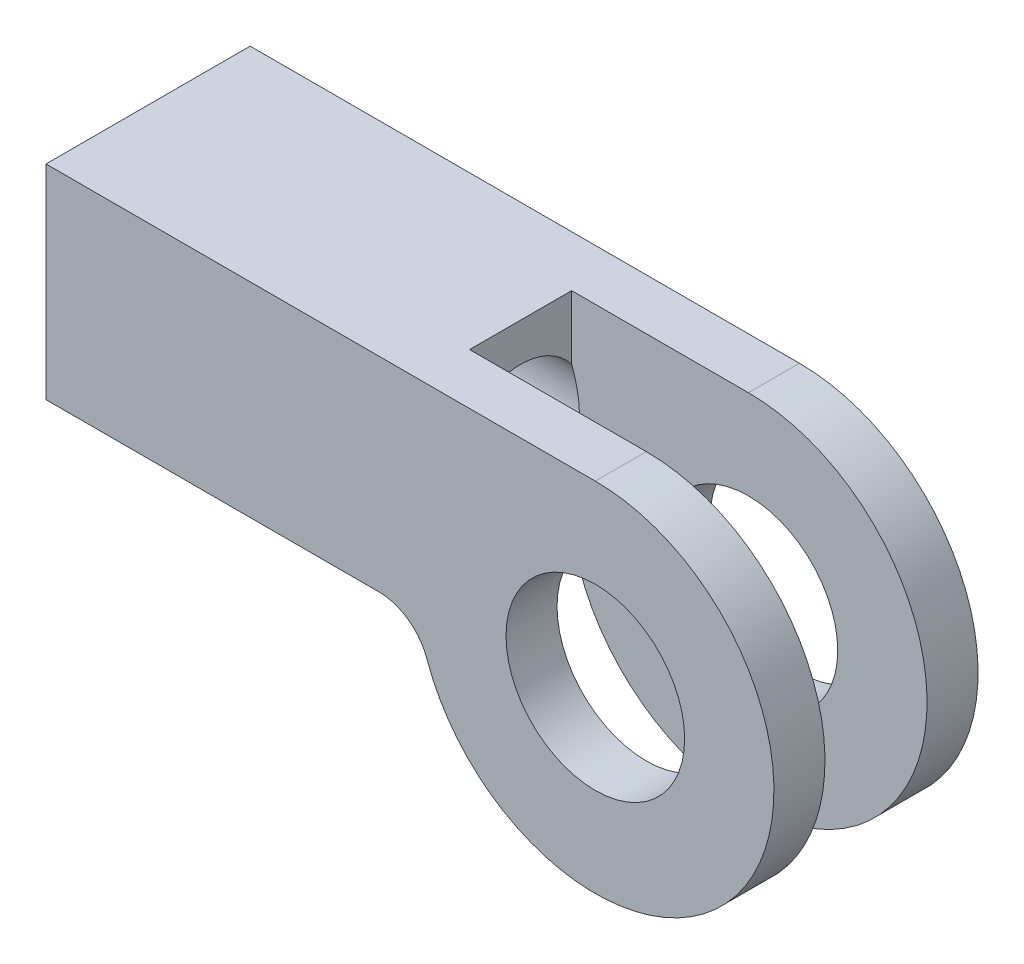
ISO-10303-21;
HEADER;
FILE_DESCRIPTION(('STEP AP214'),'2;1');
FILE_NAME('part.step','',(''),(''),'','','');
FILE_SCHEMA(('AUTOMOTIVE_DESIGN { 1 0 10303 214 1 1 1 1 }'));
ENDSEC;
DATA;
#1=APPLICATION_CONTEXT('core data for automotive mechanical design processes');
#2=APPLICATION_PROTOCOL_DEFINITION('international standard','automotive_design',2000,#1);
#3=PRODUCT_CONTEXT('',#1,'mechanical');
#4=PRODUCT('Part','Part','',(#3));
#5=PRODUCT_RELATED_PRODUCT_CATEGORY('part','',(#4));
#6=PRODUCT_DEFINITION_FORMATION('','',#4);
#7=PRODUCT_DEFINITION_CONTEXT('part definition',#1,'design');
#8=PRODUCT_DEFINITION('design','',#6,#7);
#9=PRODUCT_DEFINITION_SHAPE('','',#8);
#10=(LENGTH_UNIT() NAMED_UNIT(*) SI_UNIT(.MILLI.,.METRE.));
#11=(NAMED_UNIT(*) PLANE_ANGLE_UNIT() SI_UNIT($,.RADIAN.));
#12=(NAMED_UNIT(*) SI_UNIT($,.STERADIAN.) SOLID_ANGLE_UNIT());
#13=UNCERTAINTY_MEASURE_WITH_UNIT(LENGTH_MEASURE(1.E-05),#10,'distance_accuracy_value','');
#14=(GEOMETRIC_REPRESENTATION_CONTEXT(3) GLOBAL_UNCERTAINTY_ASSIGNED_CONTEXT((#13)) GLOBAL_UNIT_ASSIGNED_CONTEXT((#10,
#11,#12)) REPRESENTATION_CONTEXT('',''));
#15=CARTESIAN_POINT('',(0.,0.,0.));
#16=DIRECTION('',(0.,0.,1.));
#17=DIRECTION('',(1.,0.,0.));
#18=AXIS2_PLACEMENT_3D('',#15,#16,#17);
#19=CARTESIAN_POINT('',(-9.10582815572705,0.465034966302902,0.));
#20=DIRECTION('',(0.,0.,1.));
#21=DIRECTION('',(1.,0.,0.));
#22=AXIS2_PLACEMENT_3D('',#19,#20,#21);
#23=CYLINDRICAL_SURFACE('',#22,3.5);
#24=DIRECTION('',(0.,0.,1.));
#25=VECTOR('',#24,1.);
#26=CARTESIAN_POINT('',(-9.10582815572705,3.9650349663029,0.));
#27=LINE('',#26,#25);
#28=CARTESIAN_POINT('',(-9.10582815572705,3.9650349663029,1.));
#29=VERTEX_POINT('',#28);
#30=CARTESIAN_POINT('',(-9.10582815572705,3.9650349663029,2.));
#31=VERTEX_POINT('',#30);
#32=EDGE_CURVE('E115',#29,#31,#27,.T.);
#33=ORIENTED_EDGE('',*,*,#32,.T.);
#34=CARTESIAN_POINT('',(-9.10582815572705,0.465034966302902,2.));
#35=DIRECTION('',(0.,0.,1.));
#36=DIRECTION('',(1.,0.,0.));
#37=AXIS2_PLACEMENT_3D('',#34,#35,#36);
#38=CIRCLE('',#37,3.5);
#39=CARTESIAN_POINT('',(-12.4056598012642,-0.701631700363754,2.));
#40=VERTEX_POINT('',#39);
#41=EDGE_CURVE('E434',#40,#31,#38,.T.);
#42=ORIENTED_EDGE('',*,*,#41,.F.);
#43=DIRECTION('',(0.,0.,-1.));
#44=VECTOR('',#43,1.);
#45=CARTESIAN_POINT('',(-12.4056598012642,-0.701631700363745,0.));
#46=LINE('',#45,#44);
#47=CARTESIAN_POINT('',(-12.4056598012643,-0.70163170036376,1.));
#48=VERTEX_POINT('',#47);
#49=EDGE_CURVE('E366',#40,#48,#46,.T.);
#50=ORIENTED_EDGE('',*,*,#49,.T.);
#51=CARTESIAN_POINT('',(-9.10582815572705,0.465034966302902,1.));
#52=DIRECTION('',(0.,0.,1.));
#53=DIRECTION('',(1.,0.,0.));
#54=AXIS2_PLACEMENT_3D('',#51,#52,#53);
#55=CIRCLE('',#54,3.5);
#56=EDGE_CURVE('E139',#48,#29,#55,.T.);
#57=ORIENTED_EDGE('',*,*,#56,.T.);
#58=EDGE_LOOP('',(#33,#42,#50,#57));
#59=FACE_BOUND('',#58,.T.);
#60=ADVANCED_FACE('F17',(#59),#23,.T.);
#61=CARTESIAN_POINT('',(-12.5699297708479,1.9650349663029,0.));
#62=DIRECTION('',(-1.,0.,0.));
#63=DIRECTION('',(0.,0.,1.));
#64=AXIS2_PLACEMENT_3D('',#61,#62,#63);
#65=CONICAL_SURFACE('',#64,1.24999999997044,1.02974425863787);
#66=CARTESIAN_POINT('',(-12.5699297708648,1.9650349663029,0.));
#67=DIRECTION('',(-1.,0.,0.));
#68=DIRECTION('',(0.,0.,1.));
#69=AXIS2_PLACEMENT_3D('',#66,#67,#68);
#70=CIRCLE('',#69,1.25);
#71=CARTESIAN_POINT('',(-12.5699297708648,1.21503496630412,1.));
#72=VERTEX_POINT('',#71);
#73=CARTESIAN_POINT('',(-12.5699297708652,2.71503496630276,1.));
#74=VERTEX_POINT('',#73);
#75=EDGE_CURVE('E105',#72,#74,#70,.T.);
#76=ORIENTED_EDGE('',*,*,#75,.T.);
#77=CARTESIAN_POINT('',(-12.5699297708656,2.71503496630262,1.));
#78=CARTESIAN_POINT('',(-12.550445815649,2.66091059229669,1.));
#79=CARTESIAN_POINT('',(-12.532087832111,2.60631878389846,1.));
#80=CARTESIAN_POINT('',(-12.4985218750767,2.49590658564479,1.));
#81=CARTESIAN_POINT('',(-12.4833289852003,2.44008165481111,1.));
#82=CARTESIAN_POINT('',(-12.4576375594387,2.32933714336159,1.));
#83=CARTESIAN_POINT('',(-12.4469964351896,2.27445174492549,1.));
#84=CARTESIAN_POINT('',(-12.4306571914232,2.1640582727333,1.));
#85=CARTESIAN_POINT('',(-12.4249480007388,2.10855187843622,1.));
#86=CARTESIAN_POINT('',(-12.4183728722157,1.98317064342484,1.));
#87=CARTESIAN_POINT('',(-12.4190921883452,1.91320370932552,1.));
#88=CARTESIAN_POINT('',(-12.4291859411284,1.77370941449283,1.));
#89=CARTESIAN_POINT('',(-12.4385882526608,1.70418419595319,1.));
#90=CARTESIAN_POINT('',(-12.4650269131547,1.5635292599986,1.));
#91=CARTESIAN_POINT('',(-12.4823795119223,1.49246259066056,1.));
#92=CARTESIAN_POINT('',(-12.5225721537257,1.35234703336306,1.));
#93=CARTESIAN_POINT('',(-12.5453775820324,1.28328838181457,1.));
#94=CARTESIAN_POINT('',(-12.5699297708656,1.21503496630318,1.));
#95=B_SPLINE_CURVE_WITH_KNOTS('',3,(#77,#78,#79,#80,#81,#82,#83,#84,#85,#86,#87,#88,#89,#90,#91,
#92,#93,#94),.UNSPECIFIED.,.F.,.F.,(4,2,2,2,2,2,2,2,4),(0.,0.172650112651246,0.346105082496369,
0.513636827666377,0.680791514255262,0.890116754876191,1.10011633368652,1.31931132667524,
1.53715017285781),.UNSPECIFIED.);
#96=EDGE_CURVE('E130',#74,#72,#95,.T.);
#97=ORIENTED_EDGE('',*,*,#96,.T.);
#98=EDGE_LOOP('',(#76,#97));
#99=FACE_BOUND('',#98,.T.);
#100=ADVANCED_FACE('F137',(#99),#65,.F.);
#101=CARTESIAN_POINT('',(-9.10582815572705,0.465034966302902,-14.5592945360915));
#102=DIRECTION('',(0.,0.,1.));
#103=DIRECTION('',(1.,0.,0.));
#104=AXIS2_PLACEMENT_3D('',#101,#102,#103);
#105=CYLINDRICAL_SURFACE('',#104,1.75);
#106=CARTESIAN_POINT('',(-9.10582815572705,0.465034966302902,2.));
#107=DIRECTION('',(0.,0.,1.));
#108=DIRECTION('',(1.,0.,0.));
#109=AXIS2_PLACEMENT_3D('',#106,#107,#108);
#110=CIRCLE('',#109,1.75);
#111=CARTESIAN_POINT('',(-7.35582815572705,0.465034966302902,2.));
#112=VERTEX_POINT('',#111);
#113=EDGE_CURVE('E135',#112,#112,#110,.F.);
#114=ORIENTED_EDGE('',*,*,#113,.F.);
#115=EDGE_LOOP('',(#114));
#116=FACE_BOUND('',#115,.T.);
#117=CARTESIAN_POINT('',(-9.10582815572705,0.465034966302902,1.));
#118=DIRECTION('',(0.,0.,1.));
#119=DIRECTION('',(1.,0.,0.));
#120=AXIS2_PLACEMENT_3D('',#117,#118,#119);
#121=CIRCLE('',#120,1.75);
#122=CARTESIAN_POINT('',(-7.35582815572705,0.465034966302902,1.));
#123=VERTEX_POINT('',#122);
#124=EDGE_CURVE('E138',#123,#123,#121,.F.);
#125=ORIENTED_EDGE('',*,*,#124,.T.);
#126=EDGE_LOOP('',(#125));
#127=FACE_BOUND('',#126,.T.);
#128=ADVANCED_FACE('F419',(#116,#127),#105,.F.);
#129=CARTESIAN_POINT('',(-16.3199297708648,1.9650349663029,0.));
#130=DIRECTION('',(-1.,0.,0.));
#131=DIRECTION('',(0.,0.,1.));
#132=AXIS2_PLACEMENT_3D('',#129,#130,#131);
#133=CYLINDRICAL_SURFACE('',#132,1.25);
#134=CARTESIAN_POINT('',(-12.5699297708648,1.9650349663029,0.));
#135=DIRECTION('',(-1.,0.,0.));
#136=DIRECTION('',(0.,0.,1.));
#137=AXIS2_PLACEMENT_3D('',#134,#135,#136);
#138=CIRCLE('',#137,1.25);
#139=CARTESIAN_POINT('',(-12.5699297708564,1.21503496632753,-1.));
#140=VERTEX_POINT('',#139);
#141=EDGE_CURVE('E20',#72,#140,#138,.F.);
#142=ORIENTED_EDGE('',*,*,#141,.T.);
#143=CARTESIAN_POINT('',(-12.5699297708479,1.9650349663029,0.));
#144=DIRECTION('',(-1.,0.,0.));
#145=DIRECTION('',(0.,0.,1.));
#146=AXIS2_PLACEMENT_3D('',#143,#144,#145);
#147=CIRCLE('',#146,1.24999999997044);
#148=CARTESIAN_POINT('',(-12.5699297708564,2.71503496627827,-1.));
#149=VERTEX_POINT('',#148);
#150=EDGE_CURVE('E114',#140,#149,#147,.F.);
#151=ORIENTED_EDGE('',*,*,#150,.T.);
#152=CARTESIAN_POINT('',(-12.5699297708648,1.9650349663029,0.));
#153=DIRECTION('',(-1.,0.,0.));
#154=DIRECTION('',(0.,0.,1.));
#155=AXIS2_PLACEMENT_3D('',#152,#153,#154);
#156=CIRCLE('',#155,1.25);
#157=EDGE_CURVE('E111',#149,#74,#156,.F.);
#158=ORIENTED_EDGE('',*,*,#157,.T.);
#159=ORIENTED_EDGE('',*,*,#75,.F.);
#160=EDGE_LOOP('',(#142,#151,#158,#159));
#161=FACE_BOUND('',#160,.T.);
#162=CARTESIAN_POINT('',(-20.0699297708648,1.9650349663029,0.));
#163=DIRECTION('',(-1.,0.,0.));
#164=DIRECTION('',(0.,0.,1.));
#165=AXIS2_PLACEMENT_3D('',#162,#163,#164);
#166=CIRCLE('',#165,1.25);
#167=CARTESIAN_POINT('',(-20.0699297708648,1.9650349663029,1.25));
#168=VERTEX_POINT('',#167);
#169=EDGE_CURVE('E200',#168,#168,#166,.F.);
#170=ORIENTED_EDGE('',*,*,#169,.F.);
#171=EDGE_LOOP('',(#170));
#172=FACE_BOUND('',#171,.T.);
#173=ADVANCED_FACE('F107',(#161,#172),#133,.F.);
#174=CARTESIAN_POINT('',(-19.9699297708648,0.630776645657724,1.9));
#175=DIRECTION('',(-0.707106781186548,0.,0.707106781186548));
#176=DIRECTION('',(0.707106781186548,0.,0.707106781186548));
#177=AXIS2_PLACEMENT_3D('',#174,#175,#176);
#178=PLANE('',#177);
#179=DIRECTION('',(0.,1.,0.));
#180=VECTOR('',#179,1.);
#181=CARTESIAN_POINT('',(-20.0699297708648,-0.0349650336970986,1.8));
#182=LINE('',#181,#180);
#183=CARTESIAN_POINT('',(-20.0699297708648,0.165034966302901,1.8));
#184=VERTEX_POINT('',#183);
#185=CARTESIAN_POINT('',(-20.0699297708648,3.7650349663029,1.8));
#186=VERTEX_POINT('',#185);
#187=EDGE_CURVE('E197',#184,#186,#182,.T.);
#188=ORIENTED_EDGE('',*,*,#187,.F.);
#189=DIRECTION('',(-0.577350269189625,0.577350269189625,-0.577350269189628));
#190=VECTOR('',#189,1.);
#191=CARTESIAN_POINT('',(-19.8699297708648,-0.0349650336970979,2.));
#192=LINE('',#191,#190);
#193=CARTESIAN_POINT('',(-19.8699297708648,-0.0349650336970984,2.));
#194=VERTEX_POINT('',#193);
#195=EDGE_CURVE('E362',#194,#184,#192,.T.);
#196=ORIENTED_EDGE('',*,*,#195,.F.);
#197=DIRECTION('',(0.,1.,0.));
#198=VECTOR('',#197,1.);
#199=CARTESIAN_POINT('',(-19.8699297708648,1.29651832501255,2.));
#200=LINE('',#199,#198);
#201=CARTESIAN_POINT('',(-19.8699297708648,3.9650349663029,2.));
#202=VERTEX_POINT('',#201);
#203=EDGE_CURVE('E337',#202,#194,#200,.F.);
#204=ORIENTED_EDGE('',*,*,#203,.F.);
#205=DIRECTION('',(0.577350269189624,0.577350269189626,0.577350269189627));
#206=VECTOR('',#205,1.);
#207=CARTESIAN_POINT('',(-20.0699297708648,3.7650349663029,1.8));
#208=LINE('',#207,#206);
#209=EDGE_CURVE('E340',#186,#202,#208,.T.);
#210=ORIENTED_EDGE('',*,*,#209,.F.);
#211=EDGE_LOOP('',(#188,#196,#204,#210));
#212=FACE_BOUND('',#211,.T.);
#213=ADVANCED_FACE('F184',(#212),#178,.T.);
#214=CARTESIAN_POINT('',(-12.5699297708479,1.9650349663029,0.));
#215=DIRECTION('',(-1.,0.,0.));
#216=DIRECTION('',(0.,0.,1.));
#217=AXIS2_PLACEMENT_3D('',#214,#215,#216);
#218=CONICAL_SURFACE('',#217,1.24999999997044,1.02974425861138);
#219=ORIENTED_EDGE('',*,*,#150,.F.);
#220=CARTESIAN_POINT('',(-12.5699297708643,2.71503496629909,-1.));
#221=CARTESIAN_POINT('',(-12.5504458156466,2.66091059229306,-1.));
#222=CARTESIAN_POINT('',(-12.5320878321075,2.60631878389466,-1.));
#223=CARTESIAN_POINT('',(-12.4985218750712,2.4959065856405,-1.));
#224=CARTESIAN_POINT('',(-12.4833289851939,2.44008165480651,-1.));
#225=CARTESIAN_POINT('',(-12.4576375594309,2.32933714335645,-1.));
#226=CARTESIAN_POINT('',(-12.4469964351813,2.27445174492015,-1.));
#227=CARTESIAN_POINT('',(-12.4306571914141,2.16405827272748,-1.));
#228=CARTESIAN_POINT('',(-12.4249480007295,2.10855187843013,-1.));
#229=CARTESIAN_POINT('',(-12.4183728722066,1.98317064341928,-1.));
#230=CARTESIAN_POINT('',(-12.4190921883363,1.91320370932075,-1.));
#231=CARTESIAN_POINT('',(-12.4291859411204,1.77370941448971,-1.));
#232=CARTESIAN_POINT('',(-12.4385882526533,1.70418419595092,-1.));
#233=CARTESIAN_POINT('',(-12.4650269131486,1.56352925999789,-1.));
#234=CARTESIAN_POINT('',(-12.4823795119171,1.49246259066057,-1.));
#235=CARTESIAN_POINT('',(-12.5225721537224,1.35234703336471,-1.));
#236=CARTESIAN_POINT('',(-12.5453775820301,1.28328838181712,-1.));
#237=CARTESIAN_POINT('',(-12.5699297708643,1.2150349663067,-1.));
#238=B_SPLINE_CURVE_WITH_KNOTS('',3,(#220,#221,#222,#223,#224,#225,#226,#227,#228,#229,#230,
#231,#232,#233,#234,#235,#236,#237),.UNSPECIFIED.,.F.,.F.,(4,2,2,2,2,2,2,2,4),(0.,
0.172650112652738,0.346105082499481,0.513636827670369,0.680791514260072,0.890116754878579,
1.10011633368656,1.31931132667378,1.5371501728547),.UNSPECIFIED.);
#239=EDGE_CURVE('E188',#149,#140,#238,.T.);
#240=ORIENTED_EDGE('',*,*,#239,.F.);
#241=EDGE_LOOP('',(#219,#240));
#242=FACE_BOUND('',#241,.T.);
#243=ADVANCED_FACE('F179',(#242),#218,.F.);
#244=CARTESIAN_POINT('',(-13.3484688428463,-1.0349650336971,0.));
#245=DIRECTION('',(0.,0.,-1.));
#246=DIRECTION('',(-1.,0.,0.));
#247=AXIS2_PLACEMENT_3D('',#244,#245,#246);
#248=CYLINDRICAL_SURFACE('',#247,1.);
#249=ORIENTED_EDGE('',*,*,#49,.F.);
#250=CARTESIAN_POINT('',(-13.3484688428463,-1.0349650336971,2.));
#251=DIRECTION('',(0.,0.,-1.));
#252=DIRECTION('',(-1.,0.,0.));
#253=AXIS2_PLACEMENT_3D('',#250,#251,#252);
#254=CIRCLE('',#253,1.);
#255=CARTESIAN_POINT('',(-13.3484688428463,-0.0349650336970974,2.));
#256=VERTEX_POINT('',#255);
#257=EDGE_CURVE('E339',#256,#40,#254,.T.);
#258=ORIENTED_EDGE('',*,*,#257,.F.);
#259=DIRECTION('',(0.,0.,1.));
#260=VECTOR('',#259,1.);
#261=CARTESIAN_POINT('',(-13.3484688428463,-0.0349650336970974,0.));
#262=LINE('',#261,#260);
#263=CARTESIAN_POINT('',(-13.3484688428463,-0.0349650336970974,1.));
#264=VERTEX_POINT('',#263);
#265=EDGE_CURVE('E309',#264,#256,#262,.T.);
#266=ORIENTED_EDGE('',*,*,#265,.F.);
#267=CARTESIAN_POINT('',(-13.3484688428463,-1.0349650336971,1.));
#268=DIRECTION('',(0.,0.,-1.));
#269=DIRECTION('',(-1.,0.,0.));
#270=AXIS2_PLACEMENT_3D('',#267,#268,#269);
#271=CIRCLE('',#270,1.);
#272=EDGE_CURVE('E134',#264,#48,#271,.T.);
#273=ORIENTED_EDGE('',*,*,#272,.T.);
#274=EDGE_LOOP('',(#249,#258,#266,#273));
#275=FACE_BOUND('',#274,.T.);
#276=ADVANCED_FACE('F175',(#275),#248,.F.);
#277=CARTESIAN_POINT('',(-19.9699297708648,0.0650349663029015,0.));
#278=DIRECTION('',(-0.707106781186547,-0.707106781186548,0.));
#279=DIRECTION('',(0.707106781186548,-0.707106781186547,0.));
#280=AXIS2_PLACEMENT_3D('',#277,#278,#279);
#281=PLANE('',#280);
#282=DIRECTION('',(0.,0.,1.));
#283=VECTOR('',#282,1.);
#284=CARTESIAN_POINT('',(-20.0699297708648,0.165034966302901,0.));
#285=LINE('',#284,#283);
#286=CARTESIAN_POINT('',(-20.0699297708648,0.165034966302901,-1.8));
#287=VERTEX_POINT('',#286);
#288=EDGE_CURVE('E377',#287,#184,#285,.T.);
#289=ORIENTED_EDGE('',*,*,#288,.F.);
#290=DIRECTION('',(0.577350269189625,-0.577350269189625,-0.577350269189628));
#291=VECTOR('',#290,1.);
#292=CARTESIAN_POINT('',(-20.0699297708648,0.165034966302901,-1.8));
#293=LINE('',#292,#291);
#294=CARTESIAN_POINT('',(-19.8699297708648,-0.0349650336970984,-2.));
#295=VERTEX_POINT('',#294);
#296=EDGE_CURVE('E126',#287,#295,#293,.T.);
#297=ORIENTED_EDGE('',*,*,#296,.T.);
#298=DIRECTION('',(0.,0.,1.));
#299=VECTOR('',#298,1.);
#300=CARTESIAN_POINT('',(-19.8699297708648,-0.0349650336970986,0.));
#301=LINE('',#300,#299);
#302=EDGE_CURVE('E273',#194,#295,#301,.F.);
#303=ORIENTED_EDGE('',*,*,#302,.F.);
#304=ORIENTED_EDGE('',*,*,#195,.T.);
#305=EDGE_LOOP('',(#289,#297,#303,#304));
#306=FACE_BOUND('',#305,.T.);
#307=ADVANCED_FACE('F172',(#306),#281,.T.);
#308=CARTESIAN_POINT('',(-12.5699297708648,3.9650349663029,0.));
#309=DIRECTION('',(-1.,0.,0.));
#310=DIRECTION('',(0.,0.,1.));
#311=AXIS2_PLACEMENT_3D('',#308,#309,#310);
#312=PLANE('',#311);
#313=DIRECTION('',(0.,1.,0.));
#314=VECTOR('',#313,1.);
#315=CARTESIAN_POINT('',(-12.5699297708648,0.869000505628413,1.));
#316=LINE('',#315,#314);
#317=CARTESIAN_POINT('',(-12.5699297708648,-0.0349650336970972,1.));
#318=VERTEX_POINT('',#317);
#319=EDGE_CURVE('E122',#72,#318,#316,.F.);
#320=ORIENTED_EDGE('',*,*,#319,.T.);
#321=DIRECTION('',(0.,0.,1.));
#322=VECTOR('',#321,1.);
#323=CARTESIAN_POINT('',(-12.5699297708648,-0.0349650336970972,0.));
#324=LINE('',#323,#322);
#325=CARTESIAN_POINT('',(-12.5699297708648,-0.0349650336970972,-1.));
#326=VERTEX_POINT('',#325);
#327=EDGE_CURVE('E351',#326,#318,#324,.T.);
#328=ORIENTED_EDGE('',*,*,#327,.F.);
#329=DIRECTION('',(0.,1.,0.));
#330=VECTOR('',#329,1.);
#331=CARTESIAN_POINT('',(-12.5699297708648,0.869000505628413,-1.));
#332=LINE('',#331,#330);
#333=EDGE_CURVE('E125',#140,#326,#332,.F.);
#334=ORIENTED_EDGE('',*,*,#333,.F.);
#335=ORIENTED_EDGE('',*,*,#141,.F.);
#336=EDGE_LOOP('',(#320,#328,#334,#335));
#337=FACE_BOUND('',#336,.T.);
#338=ADVANCED_FACE('F120',(#337),#312,.F.);
#339=CARTESIAN_POINT('',(-19.9699297708648,3.8650349663029,0.));
#340=DIRECTION('',(-0.707106781186548,0.707106781186548,0.));
#341=DIRECTION('',(-0.707106781186548,-0.707106781186548,0.));
#342=AXIS2_PLACEMENT_3D('',#339,#340,#341);
#343=PLANE('',#342);
#344=DIRECTION('',(0.,0.,1.));
#345=VECTOR('',#344,1.);
#346=CARTESIAN_POINT('',(-20.0699297708648,3.7650349663029,0.));
#347=LINE('',#346,#345);
#348=CARTESIAN_POINT('',(-20.0699297708648,3.7650349663029,-1.8));
#349=VERTEX_POINT('',#348);
#350=EDGE_CURVE('E380',#186,#349,#347,.F.);
#351=ORIENTED_EDGE('',*,*,#350,.F.);
#352=ORIENTED_EDGE('',*,*,#209,.T.);
#353=DIRECTION('',(0.,0.,1.));
#354=VECTOR('',#353,1.);
#355=CARTESIAN_POINT('',(-19.8699297708648,3.9650349663029,0.));
#356=LINE('',#355,#354);
#357=CARTESIAN_POINT('',(-19.8699297708648,3.9650349663029,-2.));
#358=VERTEX_POINT('',#357);
#359=EDGE_CURVE('E288',#358,#202,#356,.T.);
#360=ORIENTED_EDGE('',*,*,#359,.F.);
#361=DIRECTION('',(-0.577350269189624,-0.577350269189626,0.577350269189627));
#362=VECTOR('',#361,1.);
#363=CARTESIAN_POINT('',(-19.8699297708648,3.9650349663029,-2.));
#364=LINE('',#363,#362);
#365=EDGE_CURVE('E35',#358,#349,#364,.T.);
#366=ORIENTED_EDGE('',*,*,#365,.T.);
#367=EDGE_LOOP('',(#351,#352,#360,#366));
#368=FACE_BOUND('',#367,.T.);
#369=ADVANCED_FACE('F165',(#368),#343,.T.);
#370=CARTESIAN_POINT('',(-12.9565108260485,1.29651832501255,2.));
#371=DIRECTION('',(0.,0.,1.));
#372=DIRECTION('',(1.,0.,0.));
#373=AXIS2_PLACEMENT_3D('',#370,#371,#372);
#374=PLANE('',#373);
#375=ORIENTED_EDGE('',*,*,#113,.T.);
#376=EDGE_LOOP('',(#375));
#377=FACE_BOUND('',#376,.T.);
#378=ORIENTED_EDGE('',*,*,#41,.T.);
#379=DIRECTION('',(-1.,0.,0.));
#380=VECTOR('',#379,1.);
#381=CARTESIAN_POINT('',(-20.0699297708648,3.9650349663029,2.));
#382=LINE('',#381,#380);
#383=EDGE_CURVE('E291',#202,#31,#382,.F.);
#384=ORIENTED_EDGE('',*,*,#383,.F.);
#385=ORIENTED_EDGE('',*,*,#203,.T.);
#386=DIRECTION('',(1.,0.,0.));
#387=VECTOR('',#386,1.);
#388=CARTESIAN_POINT('',(-12.5699297708648,-0.0349650336970972,2.));
#389=LINE('',#388,#387);
#390=EDGE_CURVE('E303',#256,#194,#389,.F.);
#391=ORIENTED_EDGE('',*,*,#390,.F.);
#392=ORIENTED_EDGE('',*,*,#257,.T.);
#393=EDGE_LOOP('',(#378,#384,#385,#391,#392));
#394=FACE_BOUND('',#393,.T.);
#395=ADVANCED_FACE('F160',(#377,#394),#374,.T.);
#396=CARTESIAN_POINT('',(-9.52659295997166,0.869000505628413,1.));
#397=DIRECTION('',(0.,0.,1.));
#398=DIRECTION('',(1.,0.,0.));
#399=AXIS2_PLACEMENT_3D('',#396,#397,#398);
#400=PLANE('',#399);
#401=ORIENTED_EDGE('',*,*,#124,.F.);
#402=EDGE_LOOP('',(#401));
#403=FACE_BOUND('',#402,.T.);
#404=DIRECTION('',(0.,1.,0.));
#405=VECTOR('',#404,1.);
#406=CARTESIAN_POINT('',(-12.5699297708648,3.9650349663029,1.));
#407=LINE('',#406,#405);
#408=CARTESIAN_POINT('',(-12.5699297708648,3.9650349663029,1.));
#409=VERTEX_POINT('',#408);
#410=EDGE_CURVE('E142',#74,#409,#407,.T.);
#411=ORIENTED_EDGE('',*,*,#410,.T.);
#412=DIRECTION('',(-1.,0.,0.));
#413=VECTOR('',#412,1.);
#414=CARTESIAN_POINT('',(-20.0699297708648,3.9650349663029,1.));
#415=LINE('',#414,#413);
#416=EDGE_CURVE('E321',#29,#409,#415,.T.);
#417=ORIENTED_EDGE('',*,*,#416,.F.);
#418=ORIENTED_EDGE('',*,*,#56,.F.);
#419=ORIENTED_EDGE('',*,*,#272,.F.);
#420=DIRECTION('',(1.,0.,0.));
#421=VECTOR('',#420,1.);
#422=CARTESIAN_POINT('',(-12.5699297708648,-0.0349650336970972,1.));
#423=LINE('',#422,#421);
#424=EDGE_CURVE('E133',#318,#264,#423,.F.);
#425=ORIENTED_EDGE('',*,*,#424,.F.);
#426=ORIENTED_EDGE('',*,*,#319,.F.);
#427=ORIENTED_EDGE('',*,*,#96,.F.);
#428=EDGE_LOOP('',(#411,#417,#418,#419,#425,#426,#427));
#429=FACE_BOUND('',#428,.T.);
#430=ADVANCED_FACE('F129',(#403,#429),#400,.F.);
#431=CARTESIAN_POINT('',(-12.5699297708648,3.9650349663029,0.));
#432=DIRECTION('',(-1.,0.,0.));
#433=DIRECTION('',(0.,0.,1.));
#434=AXIS2_PLACEMENT_3D('',#431,#432,#433);
#435=PLANE('',#434);
#436=DIRECTION('',(0.,1.,0.));
#437=VECTOR('',#436,1.);
#438=CARTESIAN_POINT('',(-12.5699297708648,0.869000505628413,-1.));
#439=LINE('',#438,#437);
#440=CARTESIAN_POINT('',(-12.5699297708648,3.9650349663029,-1.));
#441=VERTEX_POINT('',#440);
#442=EDGE_CURVE('E306',#441,#149,#439,.F.);
#443=ORIENTED_EDGE('',*,*,#442,.F.);
#444=DIRECTION('',(0.,0.,1.));
#445=VECTOR('',#444,1.);
#446=CARTESIAN_POINT('',(-12.5699297708648,3.9650349663029,0.));
#447=LINE('',#446,#445);
#448=EDGE_CURVE('E316',#409,#441,#447,.F.);
#449=ORIENTED_EDGE('',*,*,#448,.F.);
#450=ORIENTED_EDGE('',*,*,#410,.F.);
#451=ORIENTED_EDGE('',*,*,#157,.F.);
#452=EDGE_LOOP('',(#443,#449,#450,#451));
#453=FACE_BOUND('',#452,.T.);
#454=ADVANCED_FACE('F159',(#453),#435,.F.);
#455=CARTESIAN_POINT('',(-20.0699297708648,-0.0349650336970986,0.));
#456=DIRECTION('',(-1.,0.,0.));
#457=DIRECTION('',(0.,0.,1.));
#458=AXIS2_PLACEMENT_3D('',#455,#456,#457);
#459=PLANE('',#458);
#460=ORIENTED_EDGE('',*,*,#288,.T.);
#461=ORIENTED_EDGE('',*,*,#187,.T.);
#462=ORIENTED_EDGE('',*,*,#350,.T.);
#463=DIRECTION('',(0.,1.,0.));
#464=VECTOR('',#463,1.);
#465=CARTESIAN_POINT('',(-20.0699297708648,0.630776645657724,-1.8));
#466=LINE('',#465,#464);
#467=EDGE_CURVE('E277',#287,#349,#466,.T.);
#468=ORIENTED_EDGE('',*,*,#467,.F.);
#469=EDGE_LOOP('',(#460,#461,#462,#468));
#470=FACE_BOUND('',#469,.T.);
#471=ORIENTED_EDGE('',*,*,#169,.T.);
#472=EDGE_LOOP('',(#471));
#473=FACE_BOUND('',#472,.T.);
#474=ADVANCED_FACE('F206',(#470,#473),#459,.T.);
#475=CARTESIAN_POINT('',(-9.52659295997166,0.869000505628413,-1.));
#476=DIRECTION('',(0.,0.,1.));
#477=DIRECTION('',(1.,0.,0.));
#478=AXIS2_PLACEMENT_3D('',#475,#476,#477);
#479=PLANE('',#478);
#480=CARTESIAN_POINT('',(-9.10582815572705,0.465034966302902,-1.));
#481=DIRECTION('',(0.,0.,1.));
#482=DIRECTION('',(1.,0.,0.));
#483=AXIS2_PLACEMENT_3D('',#480,#481,#482);
#484=CIRCLE('',#483,1.75);
#485=CARTESIAN_POINT('',(-7.35582815572705,0.465034966302902,-1.));
#486=VERTEX_POINT('',#485);
#487=EDGE_CURVE('E274',#486,#486,#484,.F.);
#488=ORIENTED_EDGE('',*,*,#487,.T.);
#489=EDGE_LOOP('',(#488));
#490=FACE_BOUND('',#489,.T.);
#491=DIRECTION('',(-1.,0.,0.));
#492=VECTOR('',#491,1.);
#493=CARTESIAN_POINT('',(-20.0699297708648,3.9650349663029,-1.));
#494=LINE('',#493,#492);
#495=CARTESIAN_POINT('',(-9.10582815572705,3.9650349663029,-1.));
#496=VERTEX_POINT('',#495);
#497=EDGE_CURVE('E287',#441,#496,#494,.F.);
#498=ORIENTED_EDGE('',*,*,#497,.F.);
#499=ORIENTED_EDGE('',*,*,#442,.T.);
#500=ORIENTED_EDGE('',*,*,#239,.T.);
#501=ORIENTED_EDGE('',*,*,#333,.T.);
#502=DIRECTION('',(1.,0.,0.));
#503=VECTOR('',#502,1.);
#504=CARTESIAN_POINT('',(-12.5699297708648,-0.0349650336970972,-1.));
#505=LINE('',#504,#503);
#506=CARTESIAN_POINT('',(-13.3484688428463,-0.0349650336970986,-1.));
#507=VERTEX_POINT('',#506);
#508=EDGE_CURVE('E302',#507,#326,#505,.T.);
#509=ORIENTED_EDGE('',*,*,#508,.F.);
#510=CARTESIAN_POINT('',(-13.3484688428463,-1.0349650336971,-1.));
#511=DIRECTION('',(0.,0.,-1.));
#512=DIRECTION('',(-1.,0.,0.));
#513=AXIS2_PLACEMENT_3D('',#510,#511,#512);
#514=CIRCLE('',#513,1.);
#515=CARTESIAN_POINT('',(-12.4056598012643,-0.701631700363759,-1.));
#516=VERTEX_POINT('',#515);
#517=EDGE_CURVE('E198',#507,#516,#514,.T.);
#518=ORIENTED_EDGE('',*,*,#517,.T.);
#519=CARTESIAN_POINT('',(-9.10582815572705,0.465034966302902,-1.));
#520=DIRECTION('',(0.,0.,1.));
#521=DIRECTION('',(1.,0.,0.));
#522=AXIS2_PLACEMENT_3D('',#519,#520,#521);
#523=CIRCLE('',#522,3.5);
#524=EDGE_CURVE('E292',#496,#516,#523,.F.);
#525=ORIENTED_EDGE('',*,*,#524,.F.);
#526=EDGE_LOOP('',(#498,#499,#500,#501,#509,#518,#525));
#527=FACE_BOUND('',#526,.T.);
#528=ADVANCED_FACE('F201',(#490,#527),#479,.T.);
#529=CARTESIAN_POINT('',(-12.5699297708648,-0.0349650336970972,0.));
#530=DIRECTION('',(0.,-1.,0.));
#531=DIRECTION('',(1.,0.,0.));
#532=AXIS2_PLACEMENT_3D('',#529,#530,#531);
#533=PLANE('',#532);
#534=ORIENTED_EDGE('',*,*,#327,.T.);
#535=ORIENTED_EDGE('',*,*,#424,.T.);
#536=ORIENTED_EDGE('',*,*,#265,.T.);
#537=ORIENTED_EDGE('',*,*,#390,.T.);
#538=ORIENTED_EDGE('',*,*,#302,.T.);
#539=DIRECTION('',(1.,0.,0.));
#540=VECTOR('',#539,1.);
#541=CARTESIAN_POINT('',(-12.9565108260485,-0.0349650336970986,-2.));
#542=LINE('',#541,#540);
#543=CARTESIAN_POINT('',(-13.3484688428463,-0.0349650336970991,-2.));
#544=VERTEX_POINT('',#543);
#545=EDGE_CURVE('E265',#295,#544,#542,.T.);
#546=ORIENTED_EDGE('',*,*,#545,.T.);
#547=DIRECTION('',(0.,0.,-1.));
#548=VECTOR('',#547,1.);
#549=CARTESIAN_POINT('',(-13.3484688428463,-0.0349650336970996,0.));
#550=LINE('',#549,#548);
#551=EDGE_CURVE('E254',#544,#507,#550,.F.);
#552=ORIENTED_EDGE('',*,*,#551,.T.);
#553=ORIENTED_EDGE('',*,*,#508,.T.);
#554=EDGE_LOOP('',(#534,#535,#536,#537,#538,#546,#552,#553));
#555=FACE_BOUND('',#554,.T.);
#556=ADVANCED_FACE('F205',(#555),#533,.T.);
#557=CARTESIAN_POINT('',(-13.3484688428463,-1.0349650336971,0.));
#558=DIRECTION('',(0.,0.,-1.));
#559=DIRECTION('',(-1.,0.,0.));
#560=AXIS2_PLACEMENT_3D('',#557,#558,#559);
#561=CYLINDRICAL_SURFACE('',#560,1.);
#562=ORIENTED_EDGE('',*,*,#551,.F.);
#563=CARTESIAN_POINT('',(-13.3484688428463,-1.0349650336971,-2.));
#564=DIRECTION('',(0.,0.,-1.));
#565=DIRECTION('',(-1.,0.,0.));
#566=AXIS2_PLACEMENT_3D('',#563,#564,#565);
#567=CIRCLE('',#566,1.);
#568=CARTESIAN_POINT('',(-12.4056598012643,-0.701631700363764,-2.));
#569=VERTEX_POINT('',#568);
#570=EDGE_CURVE('E257',#544,#569,#567,.T.);
#571=ORIENTED_EDGE('',*,*,#570,.T.);
#572=DIRECTION('',(0.,0.,1.));
#573=VECTOR('',#572,1.);
#574=CARTESIAN_POINT('',(-12.4056598012643,-0.701631700363754,0.));
#575=LINE('',#574,#573);
#576=EDGE_CURVE('E299',#516,#569,#575,.F.);
#577=ORIENTED_EDGE('',*,*,#576,.F.);
#578=ORIENTED_EDGE('',*,*,#517,.F.);
#579=EDGE_LOOP('',(#562,#571,#577,#578));
#580=FACE_BOUND('',#579,.T.);
#581=ADVANCED_FACE('F242',(#580),#561,.F.);
#582=CARTESIAN_POINT('',(-9.10582815572705,0.465034966302902,0.));
#583=DIRECTION('',(0.,0.,1.));
#584=DIRECTION('',(1.,0.,0.));
#585=AXIS2_PLACEMENT_3D('',#582,#583,#584);
#586=CYLINDRICAL_SURFACE('',#585,3.5);
#587=DIRECTION('',(0.,0.,1.));
#588=VECTOR('',#587,1.);
#589=CARTESIAN_POINT('',(-9.10582815572705,3.9650349663029,0.));
#590=LINE('',#589,#588);
#591=CARTESIAN_POINT('',(-9.10582815572705,3.9650349663029,-2.));
#592=VERTEX_POINT('',#591);
#593=EDGE_CURVE('E285',#496,#592,#590,.F.);
#594=ORIENTED_EDGE('',*,*,#593,.F.);
#595=ORIENTED_EDGE('',*,*,#524,.T.);
#596=ORIENTED_EDGE('',*,*,#576,.T.);
#597=CARTESIAN_POINT('',(-9.10582815572705,0.465034966302902,-2.));
#598=DIRECTION('',(0.,0.,1.));
#599=DIRECTION('',(1.,0.,0.));
#600=AXIS2_PLACEMENT_3D('',#597,#598,#599);
#601=CIRCLE('',#600,3.5);
#602=EDGE_CURVE('E267',#569,#592,#601,.T.);
#603=ORIENTED_EDGE('',*,*,#602,.T.);
#604=EDGE_LOOP('',(#594,#595,#596,#603));
#605=FACE_BOUND('',#604,.T.);
#606=ADVANCED_FACE('F239',(#605),#586,.T.);
#607=CARTESIAN_POINT('',(-20.0699297708648,3.9650349663029,0.));
#608=DIRECTION('',(0.,1.,0.));
#609=DIRECTION('',(-1.,0.,0.));
#610=AXIS2_PLACEMENT_3D('',#607,#608,#609);
#611=PLANE('',#610);
#612=ORIENTED_EDGE('',*,*,#593,.T.);
#613=DIRECTION('',(1.,0.,0.));
#614=VECTOR('',#613,1.);
#615=CARTESIAN_POINT('',(-12.9565108260485,3.9650349663029,-2.));
#616=LINE('',#615,#614);
#617=EDGE_CURVE('E296',#592,#358,#616,.F.);
#618=ORIENTED_EDGE('',*,*,#617,.T.);
#619=ORIENTED_EDGE('',*,*,#359,.T.);
#620=ORIENTED_EDGE('',*,*,#383,.T.);
#621=ORIENTED_EDGE('',*,*,#32,.F.);
#622=ORIENTED_EDGE('',*,*,#416,.T.);
#623=ORIENTED_EDGE('',*,*,#448,.T.);
#624=ORIENTED_EDGE('',*,*,#497,.T.);
#625=EDGE_LOOP('',(#612,#618,#619,#620,#621,#622,#623,#624));
#626=FACE_BOUND('',#625,.T.);
#627=ADVANCED_FACE('F236',(#626),#611,.T.);
#628=CARTESIAN_POINT('',(-19.9699297708648,0.630776645657724,-1.9));
#629=DIRECTION('',(-0.707106781186548,0.,-0.707106781186548));
#630=DIRECTION('',(-0.707106781186548,0.,0.707106781186548));
#631=AXIS2_PLACEMENT_3D('',#628,#629,#630);
#632=PLANE('',#631);
#633=ORIENTED_EDGE('',*,*,#467,.T.);
#634=ORIENTED_EDGE('',*,*,#365,.F.);
#635=DIRECTION('',(0.,1.,0.));
#636=VECTOR('',#635,1.);
#637=CARTESIAN_POINT('',(-19.8699297708648,1.29651832501255,-2.));
#638=LINE('',#637,#636);
#639=EDGE_CURVE('E26',#358,#295,#638,.F.);
#640=ORIENTED_EDGE('',*,*,#639,.T.);
#641=ORIENTED_EDGE('',*,*,#296,.F.);
#642=EDGE_LOOP('',(#633,#634,#640,#641));
#643=FACE_BOUND('',#642,.T.);
#644=ADVANCED_FACE('F228',(#643),#632,.T.);
#645=CARTESIAN_POINT('',(-9.10582815572705,0.465034966302902,-14.5592945360915));
#646=DIRECTION('',(0.,0.,1.));
#647=DIRECTION('',(1.,0.,0.));
#648=AXIS2_PLACEMENT_3D('',#645,#646,#647);
#649=CYLINDRICAL_SURFACE('',#648,1.75);
#650=ORIENTED_EDGE('',*,*,#487,.F.);
#651=EDGE_LOOP('',(#650));
#652=FACE_BOUND('',#651,.T.);
#653=CARTESIAN_POINT('',(-9.10582815572705,0.465034966302902,-2.));
#654=DIRECTION('',(0.,0.,1.));
#655=DIRECTION('',(1.,0.,0.));
#656=AXIS2_PLACEMENT_3D('',#653,#654,#655);
#657=CIRCLE('',#656,1.75);
#658=CARTESIAN_POINT('',(-7.35582815572705,0.465034966302902,-2.));
#659=VERTEX_POINT('',#658);
#660=EDGE_CURVE('E11',#659,#659,#657,.F.);
#661=ORIENTED_EDGE('',*,*,#660,.T.);
#662=EDGE_LOOP('',(#661));
#663=FACE_BOUND('',#662,.T.);
#664=ADVANCED_FACE('F221',(#652,#663),#649,.F.);
#665=CARTESIAN_POINT('',(-12.9565108260485,1.29651832501255,-2.));
#666=DIRECTION('',(0.,0.,1.));
#667=DIRECTION('',(1.,0.,0.));
#668=AXIS2_PLACEMENT_3D('',#665,#666,#667);
#669=PLANE('',#668);
#670=ORIENTED_EDGE('',*,*,#660,.F.);
#671=EDGE_LOOP('',(#670));
#672=FACE_BOUND('',#671,.T.);
#673=ORIENTED_EDGE('',*,*,#617,.F.);
#674=ORIENTED_EDGE('',*,*,#602,.F.);
#675=ORIENTED_EDGE('',*,*,#570,.F.);
#676=ORIENTED_EDGE('',*,*,#545,.F.);
#677=ORIENTED_EDGE('',*,*,#639,.F.);
#678=EDGE_LOOP('',(#673,#674,#675,#676,#677));
#679=FACE_BOUND('',#678,.T.);
#680=ADVANCED_FACE('F219',(#672,#679),#669,.F.);
#681=CLOSED_SHELL('',(#60,#100,#128,#173,#213,#243,#276,#307,#338,#369,#395,#430,#454,#474,#528,
#556,#581,#606,#627,#644,#664,#680));
#682=MANIFOLD_SOLID_BREP('B1',#681);
#683=ADVANCED_BREP_SHAPE_REPRESENTATION('',(#18,#682),#14);
#684=SHAPE_DEFINITION_REPRESENTATION(#9,#683);
ENDSEC;
END-ISO-10303-21;
